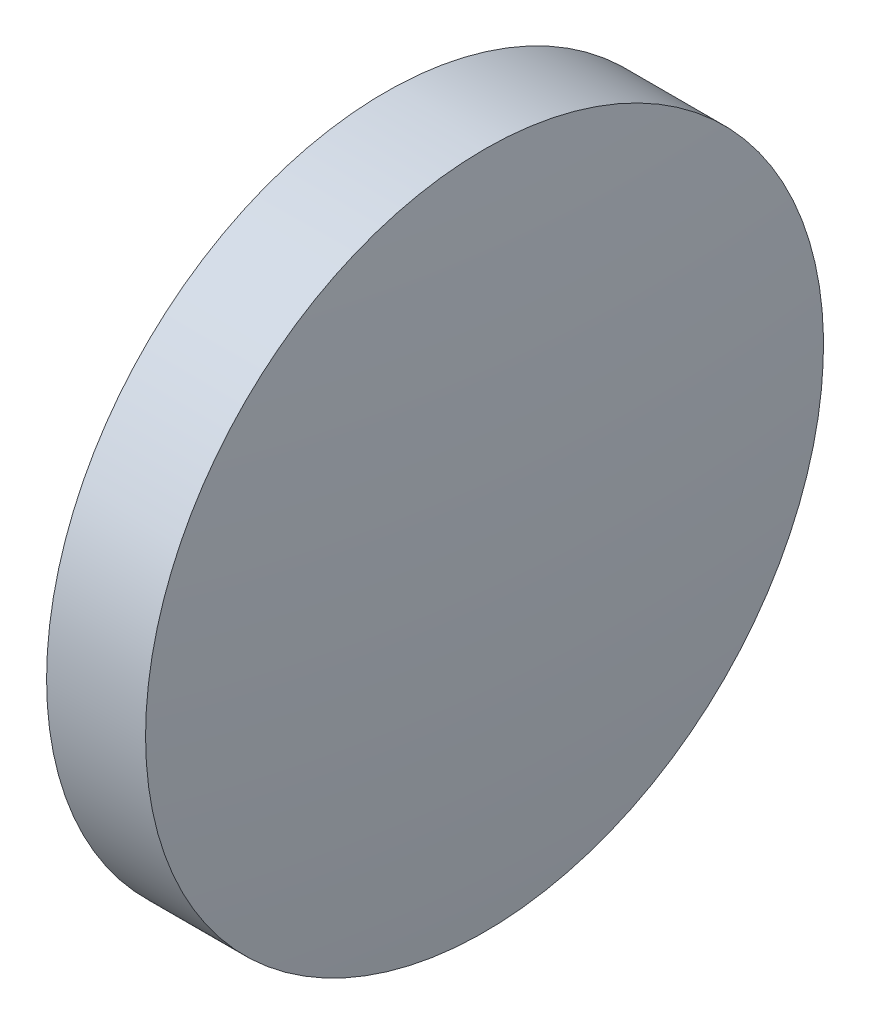
ISO-10303-21;
HEADER;
FILE_DESCRIPTION(('STEP AP214'),'2;1');
FILE_NAME('part.step','',(''),(''),'','','');
FILE_SCHEMA(('AUTOMOTIVE_DESIGN { 1 0 10303 214 1 1 1 1 }'));
ENDSEC;
DATA;
#1=APPLICATION_CONTEXT('core data for automotive mechanical design processes');
#2=APPLICATION_PROTOCOL_DEFINITION('international standard','automotive_design',2000,#1);
#3=PRODUCT_CONTEXT('',#1,'mechanical');
#4=PRODUCT('Part','Part','',(#3));
#5=PRODUCT_RELATED_PRODUCT_CATEGORY('part','',(#4));
#6=PRODUCT_DEFINITION_FORMATION('','',#4);
#7=PRODUCT_DEFINITION_CONTEXT('part definition',#1,'design');
#8=PRODUCT_DEFINITION('design','',#6,#7);
#9=PRODUCT_DEFINITION_SHAPE('','',#8);
#10=(LENGTH_UNIT() NAMED_UNIT(*) SI_UNIT(.MILLI.,.METRE.));
#11=(NAMED_UNIT(*) PLANE_ANGLE_UNIT() SI_UNIT($,.RADIAN.));
#12=(NAMED_UNIT(*) SI_UNIT($,.STERADIAN.) SOLID_ANGLE_UNIT());
#13=UNCERTAINTY_MEASURE_WITH_UNIT(LENGTH_MEASURE(1.E-05),#10,'distance_accuracy_value','');
#14=(GEOMETRIC_REPRESENTATION_CONTEXT(3) GLOBAL_UNCERTAINTY_ASSIGNED_CONTEXT((#13)) GLOBAL_UNIT_ASSIGNED_CONTEXT((#10,
#11,#12)) REPRESENTATION_CONTEXT('',''));
#15=CARTESIAN_POINT('',(0.,0.,0.));
#16=DIRECTION('',(0.,0.,1.));
#17=DIRECTION('',(1.,0.,0.));
#18=AXIS2_PLACEMENT_3D('',#15,#16,#17);
#19=CARTESIAN_POINT('',(811.742990817422,272.066761118208,0.));
#20=DIRECTION('',(-1.,0.,0.));
#21=DIRECTION('',(0.,1.,0.));
#22=AXIS2_PLACEMENT_3D('',#19,#20,#21);
#23=SPHERICAL_SURFACE('',#22,52.2033333333333);
#24=CARTESIAN_POINT('',(863.706324150755,272.066761118208,0.));
#25=DIRECTION('',(-1.,0.,0.));
#26=DIRECTION('',(0.,0.,1.));
#27=AXIS2_PLACEMENT_3D('',#24,#25,#26);
#28=CIRCLE('',#27,5.);
#29=CARTESIAN_POINT('',(863.706324150755,272.066761118208,5.));
#30=VERTEX_POINT('',#29);
#31=EDGE_CURVE('E10',#30,#30,#28,.T.);
#32=ORIENTED_EDGE('',*,*,#31,.F.);
#33=EDGE_LOOP('',(#32));
#34=FACE_BOUND('',#33,.T.);
#35=ADVANCED_FACE('F35',(#34),#23,.T.);
#36=CARTESIAN_POINT('',(861.014803576688,272.066761118208,0.));
#37=DIRECTION('',(-1.,0.,0.));
#38=DIRECTION('',(0.,0.,1.));
#39=AXIS2_PLACEMENT_3D('',#36,#37,#38);
#40=CYLINDRICAL_SURFACE('',#39,5.);
#41=CARTESIAN_POINT('',(862.246324150755,272.066761118208,0.));
#42=DIRECTION('',(-1.,0.,0.));
#43=DIRECTION('',(0.,0.,1.));
#44=AXIS2_PLACEMENT_3D('',#41,#42,#43);
#45=CIRCLE('',#44,5.);
#46=CARTESIAN_POINT('',(862.246324150755,272.066761118208,5.));
#47=VERTEX_POINT('',#46);
#48=EDGE_CURVE('E41',#47,#47,#45,.T.);
#49=ORIENTED_EDGE('',*,*,#48,.F.);
#50=EDGE_LOOP('',(#49));
#51=FACE_BOUND('',#50,.T.);
#52=ORIENTED_EDGE('',*,*,#31,.T.);
#53=EDGE_LOOP('',(#52));
#54=FACE_BOUND('',#53,.T.);
#55=ADVANCED_FACE('F49',(#51,#54),#40,.T.);
#56=CARTESIAN_POINT('',(862.246324150755,272.066761118208,0.));
#57=DIRECTION('',(1.,0.,0.));
#58=DIRECTION('',(0.,0.,-1.));
#59=AXIS2_PLACEMENT_3D('',#56,#57,#58);
#60=PLANE('',#59);
#61=ORIENTED_EDGE('',*,*,#48,.T.);
#62=EDGE_LOOP('',(#61));
#63=FACE_BOUND('',#62,.T.);
#64=ADVANCED_FACE('F47',(#63),#60,.F.);
#65=CLOSED_SHELL('',(#35,#55,#64));
#66=MANIFOLD_SOLID_BREP('B2',#65);
#67=ADVANCED_BREP_SHAPE_REPRESENTATION('',(#18,#66),#14);
#68=SHAPE_DEFINITION_REPRESENTATION(#9,#67);
ENDSEC;
END-ISO-10303-21;
